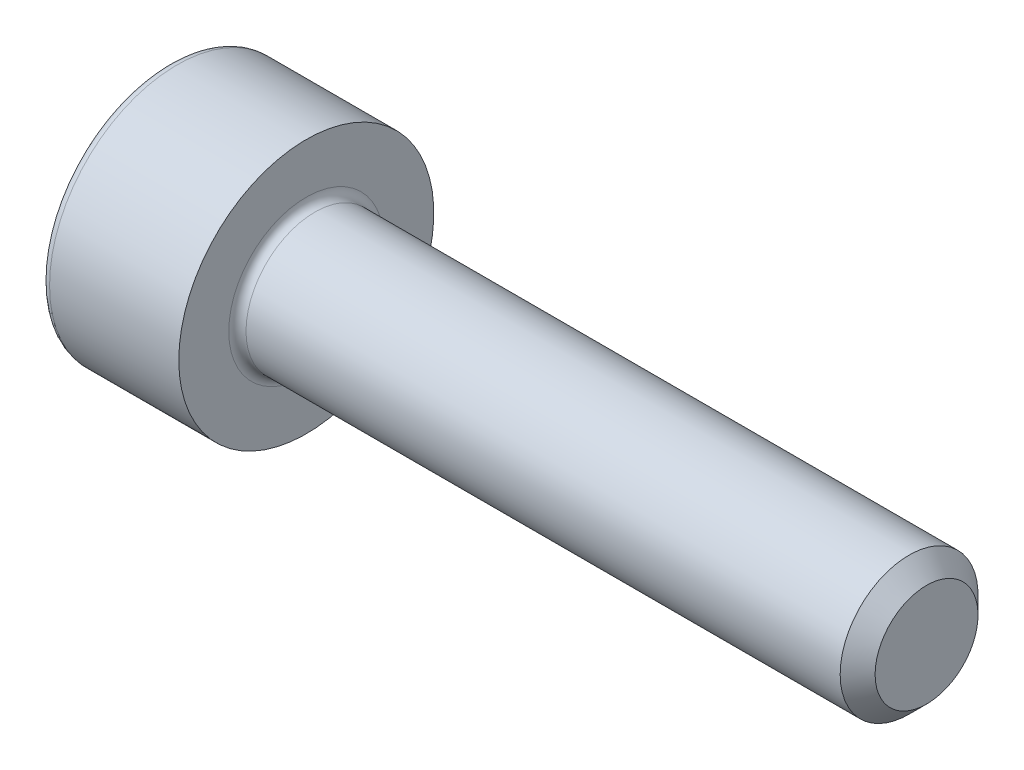
ISO-10303-21;
HEADER;
FILE_DESCRIPTION(('STEP AP214'),'2;1');
FILE_NAME('part.step','',(''),(''),'','','');
FILE_SCHEMA(('AUTOMOTIVE_DESIGN { 1 0 10303 214 1 1 1 1 }'));
ENDSEC;
DATA;
#1=APPLICATION_CONTEXT('core data for automotive mechanical design processes');
#2=APPLICATION_PROTOCOL_DEFINITION('international standard','automotive_design',2000,#1);
#3=PRODUCT_CONTEXT('',#1,'mechanical');
#4=PRODUCT('Part','Part','',(#3));
#5=PRODUCT_RELATED_PRODUCT_CATEGORY('part','',(#4));
#6=PRODUCT_DEFINITION_FORMATION('','',#4);
#7=PRODUCT_DEFINITION_CONTEXT('part definition',#1,'design');
#8=PRODUCT_DEFINITION('design','',#6,#7);
#9=PRODUCT_DEFINITION_SHAPE('','',#8);
#10=(LENGTH_UNIT() NAMED_UNIT(*) SI_UNIT(.MILLI.,.METRE.));
#11=(NAMED_UNIT(*) PLANE_ANGLE_UNIT() SI_UNIT($,.RADIAN.));
#12=(NAMED_UNIT(*) SI_UNIT($,.STERADIAN.) SOLID_ANGLE_UNIT());
#13=UNCERTAINTY_MEASURE_WITH_UNIT(LENGTH_MEASURE(1.E-05),#10,'distance_accuracy_value','');
#14=(GEOMETRIC_REPRESENTATION_CONTEXT(3) GLOBAL_UNCERTAINTY_ASSIGNED_CONTEXT((#13)) GLOBAL_UNIT_ASSIGNED_CONTEXT((#10,
#11,#12)) REPRESENTATION_CONTEXT('',''));
#15=CARTESIAN_POINT('',(0.,0.,0.));
#16=DIRECTION('',(0.,0.,1.));
#17=DIRECTION('',(1.,0.,0.));
#18=AXIS2_PLACEMENT_3D('',#15,#16,#17);
#19=CARTESIAN_POINT('',(9.,0.,0.));
#20=DIRECTION('',(-1.,0.,0.));
#21=DIRECTION('',(0.,0.,1.));
#22=AXIS2_PLACEMENT_3D('',#19,#20,#21);
#23=CONICAL_SURFACE('',#22,0.746499999993504,0.785398163397451);
#24=CARTESIAN_POINT('',(8.7464999999935,0.,0.));
#25=DIRECTION('',(-1.,0.,0.));
#26=DIRECTION('',(0.,0.,1.));
#27=AXIS2_PLACEMENT_3D('',#24,#25,#26);
#28=CIRCLE('',#27,1.);
#29=CARTESIAN_POINT('',(8.7464999999935,0.,1.));
#30=VERTEX_POINT('',#29);
#31=EDGE_CURVE('E11',#30,#30,#28,.T.);
#32=ORIENTED_EDGE('',*,*,#31,.F.);
#33=EDGE_LOOP('',(#32));
#34=FACE_BOUND('',#33,.T.);
#35=CARTESIAN_POINT('',(9.,0.,0.));
#36=DIRECTION('',(-1.,0.,0.));
#37=DIRECTION('',(0.,0.,1.));
#38=AXIS2_PLACEMENT_3D('',#35,#36,#37);
#39=CIRCLE('',#38,0.746499999993504);
#40=CARTESIAN_POINT('',(9.,0.,0.746499999993504));
#41=VERTEX_POINT('',#40);
#42=EDGE_CURVE('E134',#41,#41,#39,.T.);
#43=ORIENTED_EDGE('',*,*,#42,.T.);
#44=EDGE_LOOP('',(#43));
#45=FACE_BOUND('',#44,.T.);
#46=ADVANCED_FACE('F33',(#34,#45),#23,.T.);
#47=CARTESIAN_POINT('',(-2.,0.,0.));
#48=DIRECTION('',(-1.,0.,0.));
#49=DIRECTION('',(0.,0.,1.));
#50=AXIS2_PLACEMENT_3D('',#47,#48,#49);
#51=CYLINDRICAL_SURFACE('',#50,1.);
#52=CARTESIAN_POINT('',(0.125,0.,0.));
#53=DIRECTION('',(-1.,0.,0.));
#54=DIRECTION('',(0.,0.,1.));
#55=AXIS2_PLACEMENT_3D('',#52,#53,#54);
#56=CIRCLE('',#55,1.);
#57=CARTESIAN_POINT('',(0.125,0.,1.));
#58=VERTEX_POINT('',#57);
#59=EDGE_CURVE('E40',#58,#58,#56,.T.);
#60=ORIENTED_EDGE('',*,*,#59,.F.);
#61=EDGE_LOOP('',(#60));
#62=FACE_BOUND('',#61,.T.);
#63=ORIENTED_EDGE('',*,*,#31,.T.);
#64=EDGE_LOOP('',(#63));
#65=FACE_BOUND('',#64,.T.);
#66=ADVANCED_FACE('F158',(#62,#65),#51,.T.);
#67=CARTESIAN_POINT('',(0.125,0.,0.));
#68=DIRECTION('',(-1.,0.,0.));
#69=DIRECTION('',(0.,0.,1.));
#70=AXIS2_PLACEMENT_3D('',#67,#68,#69);
#71=TOROIDAL_SURFACE('',#70,1.125,0.125);
#72=CARTESIAN_POINT('',(0.,0.,0.));
#73=DIRECTION('',(-1.,0.,0.));
#74=DIRECTION('',(0.,0.,1.));
#75=AXIS2_PLACEMENT_3D('',#72,#73,#74);
#76=CIRCLE('',#75,1.125);
#77=CARTESIAN_POINT('',(0.,0.,1.125));
#78=VERTEX_POINT('',#77);
#79=EDGE_CURVE('E151',#78,#78,#76,.T.);
#80=ORIENTED_EDGE('',*,*,#79,.F.);
#81=EDGE_LOOP('',(#80));
#82=FACE_BOUND('',#81,.T.);
#83=ORIENTED_EDGE('',*,*,#59,.T.);
#84=EDGE_LOOP('',(#83));
#85=FACE_BOUND('',#84,.T.);
#86=ADVANCED_FACE('F156',(#82,#85),#71,.F.);
#87=CARTESIAN_POINT('',(0.,1.125,0.));
#88=DIRECTION('',(-1.,0.,0.));
#89=DIRECTION('',(0.,0.,1.));
#90=AXIS2_PLACEMENT_3D('',#87,#88,#89);
#91=PLANE('',#90);
#92=CARTESIAN_POINT('',(0.,0.,0.));
#93=DIRECTION('',(-1.,0.,0.));
#94=DIRECTION('',(0.,0.,1.));
#95=AXIS2_PLACEMENT_3D('',#92,#93,#94);
#96=CIRCLE('',#95,1.85);
#97=CARTESIAN_POINT('',(0.,0.,1.85));
#98=VERTEX_POINT('',#97);
#99=EDGE_CURVE('E148',#98,#98,#96,.T.);
#100=ORIENTED_EDGE('',*,*,#99,.F.);
#101=EDGE_LOOP('',(#100));
#102=FACE_BOUND('',#101,.T.);
#103=ORIENTED_EDGE('',*,*,#79,.T.);
#104=EDGE_LOOP('',(#103));
#105=FACE_BOUND('',#104,.T.);
#106=ADVANCED_FACE('F189',(#102,#105),#91,.F.);
#107=CARTESIAN_POINT('',(-2.,0.,0.));
#108=DIRECTION('',(-1.,0.,0.));
#109=DIRECTION('',(0.,0.,1.));
#110=AXIS2_PLACEMENT_3D('',#107,#108,#109);
#111=CYLINDRICAL_SURFACE('',#110,1.85);
#112=CARTESIAN_POINT('',(-1.875,0.,0.));
#113=DIRECTION('',(-1.,0.,0.));
#114=DIRECTION('',(0.,0.,1.));
#115=AXIS2_PLACEMENT_3D('',#112,#113,#114);
#116=CIRCLE('',#115,1.85);
#117=CARTESIAN_POINT('',(-1.875,0.,1.85));
#118=VERTEX_POINT('',#117);
#119=EDGE_CURVE('E145',#118,#118,#116,.T.);
#120=ORIENTED_EDGE('',*,*,#119,.F.);
#121=EDGE_LOOP('',(#120));
#122=FACE_BOUND('',#121,.T.);
#123=ORIENTED_EDGE('',*,*,#99,.T.);
#124=EDGE_LOOP('',(#123));
#125=FACE_BOUND('',#124,.T.);
#126=ADVANCED_FACE('F185',(#122,#125),#111,.T.);
#127=CARTESIAN_POINT('',(-1.875,0.,0.));
#128=DIRECTION('',(-1.,0.,0.));
#129=DIRECTION('',(0.,0.,1.));
#130=AXIS2_PLACEMENT_3D('',#127,#128,#129);
#131=TOROIDAL_SURFACE('',#130,1.725,0.125);
#132=CARTESIAN_POINT('',(-2.,0.,0.));
#133=DIRECTION('',(-1.,0.,0.));
#134=DIRECTION('',(0.,0.,1.));
#135=AXIS2_PLACEMENT_3D('',#132,#133,#134);
#136=CIRCLE('',#135,1.725);
#137=CARTESIAN_POINT('',(-2.,0.,1.725));
#138=VERTEX_POINT('',#137);
#139=EDGE_CURVE('E142',#138,#138,#136,.T.);
#140=ORIENTED_EDGE('',*,*,#139,.F.);
#141=EDGE_LOOP('',(#140));
#142=FACE_BOUND('',#141,.T.);
#143=ORIENTED_EDGE('',*,*,#119,.T.);
#144=EDGE_LOOP('',(#143));
#145=FACE_BOUND('',#144,.T.);
#146=ADVANCED_FACE('F178',(#142,#145),#131,.T.);
#147=CARTESIAN_POINT('',(-2.,1.725,0.));
#148=DIRECTION('',(1.,0.,0.));
#149=DIRECTION('',(0.,0.,-1.));
#150=AXIS2_PLACEMENT_3D('',#147,#148,#149);
#151=PLANE('',#150);
#152=DIRECTION('',(0.,0.5,-0.866025403784438));
#153=VECTOR('',#152,1.);
#154=CARTESIAN_POINT('',(-2.,0.433012701892219,0.75));
#155=LINE('',#154,#153);
#156=CARTESIAN_POINT('',(-2.,0.433012701892219,0.75));
#157=VERTEX_POINT('',#156);
#158=CARTESIAN_POINT('',(-2.,0.866025403784439,0.));
#159=VERTEX_POINT('',#158);
#160=EDGE_CURVE('E121',#157,#159,#155,.T.);
#161=ORIENTED_EDGE('',*,*,#160,.F.);
#162=DIRECTION('',(0.,1.,0.));
#163=VECTOR('',#162,1.);
#164=CARTESIAN_POINT('',(-2.,-0.43301270189222,0.75));
#165=LINE('',#164,#163);
#166=CARTESIAN_POINT('',(-2.,-0.43301270189222,0.75));
#167=VERTEX_POINT('',#166);
#168=EDGE_CURVE('E47',#167,#157,#165,.T.);
#169=ORIENTED_EDGE('',*,*,#168,.F.);
#170=DIRECTION('',(0.,0.5,0.866025403784439));
#171=VECTOR('',#170,1.);
#172=CARTESIAN_POINT('',(-2.,-0.866025403784439,0.));
#173=LINE('',#172,#171);
#174=CARTESIAN_POINT('',(-2.,-0.866025403784439,0.));
#175=VERTEX_POINT('',#174);
#176=EDGE_CURVE('E130',#175,#167,#173,.T.);
#177=ORIENTED_EDGE('',*,*,#176,.F.);
#178=DIRECTION('',(0.,-0.5,0.866025403784439));
#179=VECTOR('',#178,1.);
#180=CARTESIAN_POINT('',(-2.,-0.433012701892219,-0.75));
#181=LINE('',#180,#179);
#182=CARTESIAN_POINT('',(-2.,-0.433012701892219,-0.75));
#183=VERTEX_POINT('',#182);
#184=EDGE_CURVE('E128',#183,#175,#181,.T.);
#185=ORIENTED_EDGE('',*,*,#184,.F.);
#186=DIRECTION('',(0.,-1.,0.));
#187=VECTOR('',#186,1.);
#188=CARTESIAN_POINT('',(-2.,0.43301270189222,-0.75));
#189=LINE('',#188,#187);
#190=CARTESIAN_POINT('',(-2.,0.43301270189222,-0.75));
#191=VERTEX_POINT('',#190);
#192=EDGE_CURVE('E95',#191,#183,#189,.T.);
#193=ORIENTED_EDGE('',*,*,#192,.F.);
#194=DIRECTION('',(0.,-0.5,-0.866025403784439));
#195=VECTOR('',#194,1.);
#196=CARTESIAN_POINT('',(-2.,0.866025403784439,0.));
#197=LINE('',#196,#195);
#198=EDGE_CURVE('E124',#159,#191,#197,.T.);
#199=ORIENTED_EDGE('',*,*,#198,.F.);
#200=EDGE_LOOP('',(#161,#169,#177,#185,#193,#199));
#201=FACE_BOUND('',#200,.T.);
#202=ORIENTED_EDGE('',*,*,#139,.T.);
#203=EDGE_LOOP('',(#202));
#204=FACE_BOUND('',#203,.T.);
#205=ADVANCED_FACE('F170',(#201,#204),#151,.F.);
#206=CARTESIAN_POINT('',(9.,0.746499999993504,0.));
#207=DIRECTION('',(-1.,0.,0.));
#208=DIRECTION('',(0.,0.,1.));
#209=AXIS2_PLACEMENT_3D('',#206,#207,#208);
#210=PLANE('',#209);
#211=ORIENTED_EDGE('',*,*,#42,.F.);
#212=EDGE_LOOP('',(#211));
#213=FACE_BOUND('',#212,.T.);
#214=ADVANCED_FACE('F167',(#213),#210,.F.);
#215=CARTESIAN_POINT('',(-0.9,-0.43301270189222,0.75));
#216=DIRECTION('',(0.,0.,1.));
#217=DIRECTION('',(1.,0.,0.));
#218=AXIS2_PLACEMENT_3D('',#215,#216,#217);
#219=PLANE('',#218);
#220=ORIENTED_EDGE('',*,*,#168,.T.);
#221=DIRECTION('',(-1.,0.,0.));
#222=VECTOR('',#221,1.);
#223=CARTESIAN_POINT('',(-0.9,0.433012701892219,0.75));
#224=LINE('',#223,#222);
#225=CARTESIAN_POINT('',(-0.9,0.433012701892219,0.75));
#226=VERTEX_POINT('',#225);
#227=EDGE_CURVE('E77',#226,#157,#224,.T.);
#228=ORIENTED_EDGE('',*,*,#227,.F.);
#229=DIRECTION('',(0.,1.,0.));
#230=VECTOR('',#229,1.);
#231=CARTESIAN_POINT('',(-0.9,-0.43301270189222,0.75));
#232=LINE('',#231,#230);
#233=CARTESIAN_POINT('',(-0.9,-0.43301270189222,0.75));
#234=VERTEX_POINT('',#233);
#235=EDGE_CURVE('E132',#234,#226,#232,.T.);
#236=ORIENTED_EDGE('',*,*,#235,.F.);
#237=DIRECTION('',(-1.,0.,0.));
#238=VECTOR('',#237,1.);
#239=CARTESIAN_POINT('',(-0.9,-0.43301270189222,0.75));
#240=LINE('',#239,#238);
#241=EDGE_CURVE('E55',#234,#167,#240,.T.);
#242=ORIENTED_EDGE('',*,*,#241,.T.);
#243=EDGE_LOOP('',(#220,#228,#236,#242));
#244=FACE_BOUND('',#243,.T.);
#245=ADVANCED_FACE('F169',(#244),#219,.F.);
#246=CARTESIAN_POINT('',(-0.9,-0.866025403784439,0.));
#247=DIRECTION('',(0.,-0.866025403784439,0.5));
#248=DIRECTION('',(0.,-0.5,-0.866025403784439));
#249=AXIS2_PLACEMENT_3D('',#246,#247,#248);
#250=PLANE('',#249);
#251=ORIENTED_EDGE('',*,*,#176,.T.);
#252=ORIENTED_EDGE('',*,*,#241,.F.);
#253=DIRECTION('',(0.,0.5,0.866025403784439));
#254=VECTOR('',#253,1.);
#255=CARTESIAN_POINT('',(-0.9,-0.866025403784439,0.));
#256=LINE('',#255,#254);
#257=CARTESIAN_POINT('',(-0.9,-0.866025403784439,0.));
#258=VERTEX_POINT('',#257);
#259=EDGE_CURVE('E107',#258,#234,#256,.T.);
#260=ORIENTED_EDGE('',*,*,#259,.F.);
#261=DIRECTION('',(-1.,0.,0.));
#262=VECTOR('',#261,1.);
#263=CARTESIAN_POINT('',(-0.9,-0.866025403784439,0.));
#264=LINE('',#263,#262);
#265=EDGE_CURVE('E99',#258,#175,#264,.T.);
#266=ORIENTED_EDGE('',*,*,#265,.T.);
#267=EDGE_LOOP('',(#251,#252,#260,#266));
#268=FACE_BOUND('',#267,.T.);
#269=ADVANCED_FACE('F176',(#268),#250,.F.);
#270=CARTESIAN_POINT('',(-0.9,-0.433012701892219,-0.75));
#271=DIRECTION('',(0.,-0.866025403784439,-0.5));
#272=DIRECTION('',(0.,0.5,-0.866025403784439));
#273=AXIS2_PLACEMENT_3D('',#270,#271,#272);
#274=PLANE('',#273);
#275=ORIENTED_EDGE('',*,*,#184,.T.);
#276=ORIENTED_EDGE('',*,*,#265,.F.);
#277=DIRECTION('',(0.,-0.5,0.866025403784439));
#278=VECTOR('',#277,1.);
#279=CARTESIAN_POINT('',(-0.9,-0.433012701892219,-0.75));
#280=LINE('',#279,#278);
#281=CARTESIAN_POINT('',(-0.9,-0.433012701892219,-0.75));
#282=VERTEX_POINT('',#281);
#283=EDGE_CURVE('E103',#282,#258,#280,.T.);
#284=ORIENTED_EDGE('',*,*,#283,.F.);
#285=DIRECTION('',(-1.,0.,0.));
#286=VECTOR('',#285,1.);
#287=CARTESIAN_POINT('',(-0.9,-0.433012701892219,-0.75));
#288=LINE('',#287,#286);
#289=EDGE_CURVE('E88',#282,#183,#288,.T.);
#290=ORIENTED_EDGE('',*,*,#289,.T.);
#291=EDGE_LOOP('',(#275,#276,#284,#290));
#292=FACE_BOUND('',#291,.T.);
#293=ADVANCED_FACE('F104',(#292),#274,.F.);
#294=CARTESIAN_POINT('',(-0.9,0.43301270189222,-0.75));
#295=DIRECTION('',(0.,0.,-1.));
#296=DIRECTION('',(0.,1.,0.));
#297=AXIS2_PLACEMENT_3D('',#294,#295,#296);
#298=PLANE('',#297);
#299=ORIENTED_EDGE('',*,*,#192,.T.);
#300=ORIENTED_EDGE('',*,*,#289,.F.);
#301=DIRECTION('',(0.,-1.,0.));
#302=VECTOR('',#301,1.);
#303=CARTESIAN_POINT('',(-0.9,0.43301270189222,-0.75));
#304=LINE('',#303,#302);
#305=CARTESIAN_POINT('',(-0.9,0.43301270189222,-0.75));
#306=VERTEX_POINT('',#305);
#307=EDGE_CURVE('E92',#306,#282,#304,.T.);
#308=ORIENTED_EDGE('',*,*,#307,.F.);
#309=DIRECTION('',(-1.,0.,0.));
#310=VECTOR('',#309,1.);
#311=CARTESIAN_POINT('',(-0.9,0.43301270189222,-0.75));
#312=LINE('',#311,#310);
#313=EDGE_CURVE('E100',#306,#191,#312,.T.);
#314=ORIENTED_EDGE('',*,*,#313,.T.);
#315=EDGE_LOOP('',(#299,#300,#308,#314));
#316=FACE_BOUND('',#315,.T.);
#317=ADVANCED_FACE('F90',(#316),#298,.F.);
#318=CARTESIAN_POINT('',(-0.9,0.866025403784439,0.));
#319=DIRECTION('',(0.,0.866025403784439,-0.5));
#320=DIRECTION('',(0.,0.5,0.866025403784439));
#321=AXIS2_PLACEMENT_3D('',#318,#319,#320);
#322=PLANE('',#321);
#323=ORIENTED_EDGE('',*,*,#198,.T.);
#324=ORIENTED_EDGE('',*,*,#313,.F.);
#325=DIRECTION('',(0.,-0.5,-0.866025403784439));
#326=VECTOR('',#325,1.);
#327=CARTESIAN_POINT('',(-0.9,0.866025403784439,0.));
#328=LINE('',#327,#326);
#329=CARTESIAN_POINT('',(-0.9,0.866025403784439,0.));
#330=VERTEX_POINT('',#329);
#331=EDGE_CURVE('E113',#330,#306,#328,.T.);
#332=ORIENTED_EDGE('',*,*,#331,.F.);
#333=DIRECTION('',(-1.,0.,0.));
#334=VECTOR('',#333,1.);
#335=CARTESIAN_POINT('',(-0.9,0.866025403784439,0.));
#336=LINE('',#335,#334);
#337=EDGE_CURVE('E137',#330,#159,#336,.T.);
#338=ORIENTED_EDGE('',*,*,#337,.T.);
#339=EDGE_LOOP('',(#323,#324,#332,#338));
#340=FACE_BOUND('',#339,.T.);
#341=ADVANCED_FACE('F251',(#340),#322,.F.);
#342=CARTESIAN_POINT('',(-0.9,0.433012701892219,0.75));
#343=DIRECTION('',(0.,0.866025403784439,0.5));
#344=DIRECTION('',(0.,-0.5,0.866025403784438));
#345=AXIS2_PLACEMENT_3D('',#342,#343,#344);
#346=PLANE('',#345);
#347=ORIENTED_EDGE('',*,*,#160,.T.);
#348=ORIENTED_EDGE('',*,*,#337,.F.);
#349=DIRECTION('',(0.,0.5,-0.866025403784438));
#350=VECTOR('',#349,1.);
#351=CARTESIAN_POINT('',(-0.9,0.433012701892219,0.75));
#352=LINE('',#351,#350);
#353=EDGE_CURVE('E115',#226,#330,#352,.T.);
#354=ORIENTED_EDGE('',*,*,#353,.F.);
#355=ORIENTED_EDGE('',*,*,#227,.T.);
#356=EDGE_LOOP('',(#347,#348,#354,#355));
#357=FACE_BOUND('',#356,.T.);
#358=ADVANCED_FACE('F260',(#357),#346,.F.);
#359=CARTESIAN_POINT('',(-0.9,0.,0.));
#360=DIRECTION('',(-1.,0.,0.));
#361=DIRECTION('',(0.,0.,1.));
#362=AXIS2_PLACEMENT_3D('',#359,#360,#361);
#363=PLANE('',#362);
#364=ORIENTED_EDGE('',*,*,#235,.T.);
#365=ORIENTED_EDGE('',*,*,#353,.T.);
#366=ORIENTED_EDGE('',*,*,#331,.T.);
#367=ORIENTED_EDGE('',*,*,#307,.T.);
#368=ORIENTED_EDGE('',*,*,#283,.T.);
#369=ORIENTED_EDGE('',*,*,#259,.T.);
#370=EDGE_LOOP('',(#364,#365,#366,#367,#368,#369));
#371=FACE_BOUND('',#370,.T.);
#372=ADVANCED_FACE('F110',(#371),#363,.T.);
#373=CLOSED_SHELL('',(#46,#66,#86,#106,#126,#146,#205,#214,#245,#269,#293,#317,#341,#358,#372));
#374=MANIFOLD_SOLID_BREP('B2',#373);
#375=ADVANCED_BREP_SHAPE_REPRESENTATION('',(#18,#374),#14);
#376=SHAPE_DEFINITION_REPRESENTATION(#9,#375);
ENDSEC;
END-ISO-10303-21;
